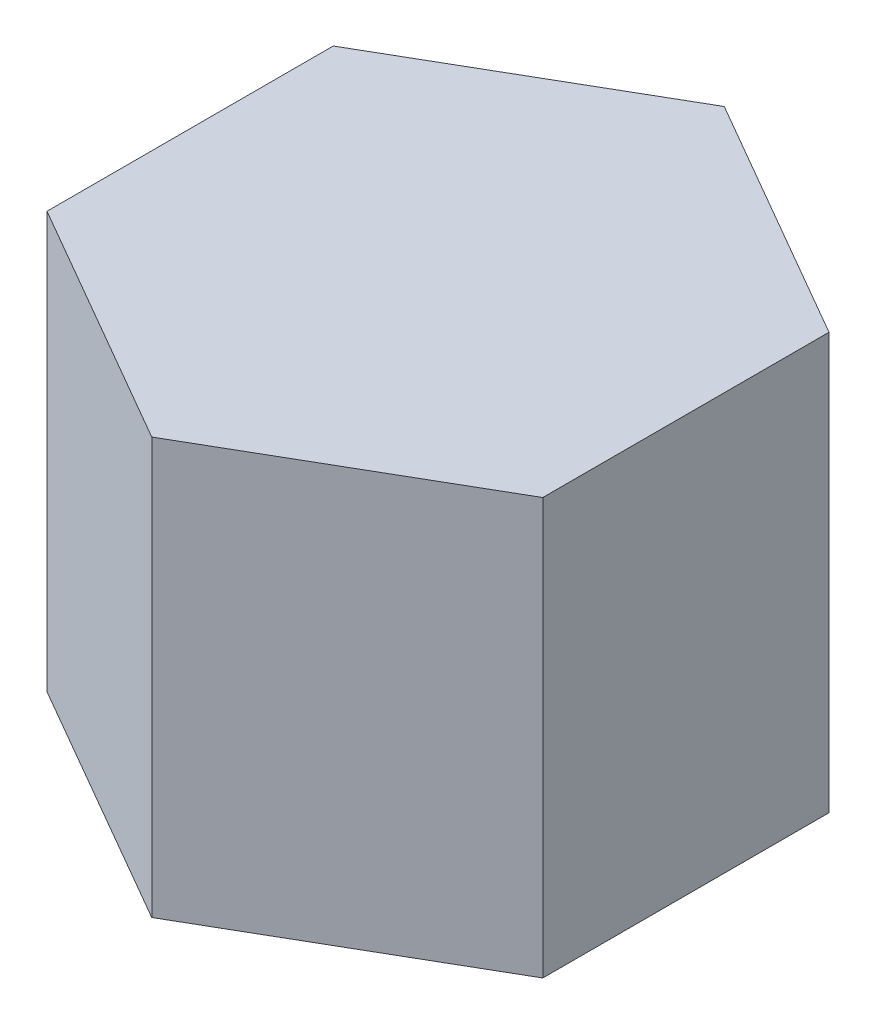
ISO-10303-21;
HEADER;
FILE_DESCRIPTION(('STEP AP214'),'2;1');
FILE_NAME('part.step','',(''),(''),'','','');
FILE_SCHEMA(('AUTOMOTIVE_DESIGN { 1 0 10303 214 1 1 1 1 }'));
ENDSEC;
DATA;
#1=APPLICATION_CONTEXT('core data for automotive mechanical design processes');
#2=APPLICATION_PROTOCOL_DEFINITION('international standard','automotive_design',2000,#1);
#3=PRODUCT_CONTEXT('',#1,'mechanical');
#4=PRODUCT('Part','Part','',(#3));
#5=PRODUCT_RELATED_PRODUCT_CATEGORY('part','',(#4));
#6=PRODUCT_DEFINITION_FORMATION('','',#4);
#7=PRODUCT_DEFINITION_CONTEXT('part definition',#1,'design');
#8=PRODUCT_DEFINITION('design','',#6,#7);
#9=PRODUCT_DEFINITION_SHAPE('','',#8);
#10=(LENGTH_UNIT() NAMED_UNIT(*) SI_UNIT(.MILLI.,.METRE.));
#11=(NAMED_UNIT(*) PLANE_ANGLE_UNIT() SI_UNIT($,.RADIAN.));
#12=(NAMED_UNIT(*) SI_UNIT($,.STERADIAN.) SOLID_ANGLE_UNIT());
#13=UNCERTAINTY_MEASURE_WITH_UNIT(LENGTH_MEASURE(1.E-05),#10,'distance_accuracy_value','');
#14=(GEOMETRIC_REPRESENTATION_CONTEXT(3) GLOBAL_UNCERTAINTY_ASSIGNED_CONTEXT((#13)) GLOBAL_UNIT_ASSIGNED_CONTEXT((#10,
#11,#12)) REPRESENTATION_CONTEXT('',''));
#15=CARTESIAN_POINT('',(0.,0.,0.));
#16=DIRECTION('',(0.,0.,1.));
#17=DIRECTION('',(1.,0.,0.));
#18=AXIS2_PLACEMENT_3D('',#15,#16,#17);
#19=CARTESIAN_POINT('',(210.839551417381,-147.556598747966,294.280047431848));
#20=DIRECTION('',(-0.499999999999943,0.,-0.866025403784471));
#21=DIRECTION('',(-0.866025403784471,0.,0.499999999999943));
#22=AXIS2_PLACEMENT_3D('',#19,#20,#21);
#23=PLANE('',#22);
#24=CARTESIAN_POINT('',(211.142660308706,-147.047793579175,294.105047431848));
#25=DIRECTION('',(-0.866025403784471,0.,0.499999999999943));
#26=VECTOR('',#25,1.);
#27=LINE('',#24,#26);
#28=CARTESIAN_POINT('',(211.142660308706,-147.047793579175,294.105047431848));
#29=VERTEX_POINT('',#28);
#30=CARTESIAN_POINT('',(210.839551417382,-147.047793579175,294.280047431848));
#31=VERTEX_POINT('',#30);
#32=EDGE_CURVE('E170',#29,#31,#27,.T.);
#33=ORIENTED_EDGE('',*,*,#32,.T.);
#34=CARTESIAN_POINT('',(210.839551417382,-147.556598747966,294.280047431848));
#35=DIRECTION('',(0.,1.,0.));
#36=VECTOR('',#35,1.);
#37=LINE('',#34,#36);
#38=CARTESIAN_POINT('',(210.839551417382,-147.556598747966,294.280047431848));
#39=VERTEX_POINT('',#38);
#40=EDGE_CURVE('E35',#39,#31,#37,.T.);
#41=ORIENTED_EDGE('',*,*,#40,.F.);
#42=CARTESIAN_POINT('',(211.142660308706,-147.556598747966,294.105047431848));
#43=DIRECTION('',(-0.866025403784471,0.,0.499999999999943));
#44=VECTOR('',#43,1.);
#45=LINE('',#42,#44);
#46=CARTESIAN_POINT('',(211.142660308706,-147.556598747966,294.105047431848));
#47=VERTEX_POINT('',#46);
#48=EDGE_CURVE('E159',#47,#39,#45,.T.);
#49=ORIENTED_EDGE('',*,*,#48,.F.);
#50=CARTESIAN_POINT('',(211.142660308706,-147.556598747966,294.105047431848));
#51=DIRECTION('',(0.,1.,0.));
#52=VECTOR('',#51,1.);
#53=LINE('',#50,#52);
#54=EDGE_CURVE('E10',#47,#29,#53,.T.);
#55=ORIENTED_EDGE('',*,*,#54,.T.);
#56=EDGE_LOOP('',(#33,#41,#49,#55));
#57=FACE_BOUND('',#56,.T.);
#58=ADVANCED_FACE('F16',(#57),#23,.F.);
#59=CARTESIAN_POINT('',(211.142660308706,-147.556598747966,291.594471220494));
#60=DIRECTION('',(-1.,0.,0.));
#61=DIRECTION('',(0.,-1.,0.));
#62=AXIS2_PLACEMENT_3D('',#59,#60,#61);
#63=PLANE('',#62);
#64=CARTESIAN_POINT('',(211.142660308706,-147.047793579175,293.755047431848));
#65=DIRECTION('',(0.,0.,1.));
#66=VECTOR('',#65,1.);
#67=LINE('',#64,#66);
#68=CARTESIAN_POINT('',(211.142660308706,-147.047793579175,293.755047431848));
#69=VERTEX_POINT('',#68);
#70=EDGE_CURVE('E167',#69,#29,#67,.T.);
#71=ORIENTED_EDGE('',*,*,#70,.T.);
#72=ORIENTED_EDGE('',*,*,#54,.F.);
#73=CARTESIAN_POINT('',(211.142660308706,-147.556598747966,293.755047431848));
#74=DIRECTION('',(0.,0.,1.));
#75=VECTOR('',#74,1.);
#76=LINE('',#73,#75);
#77=CARTESIAN_POINT('',(211.142660308706,-147.556598747966,293.755047431848));
#78=VERTEX_POINT('',#77);
#79=EDGE_CURVE('E156',#78,#47,#76,.T.);
#80=ORIENTED_EDGE('',*,*,#79,.F.);
#81=CARTESIAN_POINT('',(211.142660308706,-147.556598747966,293.755047431848));
#82=DIRECTION('',(0.,1.,0.));
#83=VECTOR('',#82,1.);
#84=LINE('',#81,#83);
#85=EDGE_CURVE('E27',#78,#69,#84,.T.);
#86=ORIENTED_EDGE('',*,*,#85,.T.);
#87=EDGE_LOOP('',(#71,#72,#80,#86));
#88=FACE_BOUND('',#87,.T.);
#89=ADVANCED_FACE('F189',(#88),#63,.F.);
#90=CARTESIAN_POINT('',(211.142660308706,-147.556598747966,293.755047431848));
#91=DIRECTION('',(-0.500000000000096,0.,0.866025403784383));
#92=DIRECTION('',(0.866025403784383,0.,0.500000000000096));
#93=AXIS2_PLACEMENT_3D('',#90,#91,#92);
#94=PLANE('',#93);
#95=CARTESIAN_POINT('',(210.839551417382,-147.047793579175,293.580047431848));
#96=DIRECTION('',(0.866025403784383,0.,0.500000000000096));
#97=VECTOR('',#96,1.);
#98=LINE('',#95,#97);
#99=CARTESIAN_POINT('',(210.839551417382,-147.047793579175,293.580047431848));
#100=VERTEX_POINT('',#99);
#101=EDGE_CURVE('E163',#100,#69,#98,.T.);
#102=ORIENTED_EDGE('',*,*,#101,.T.);
#103=ORIENTED_EDGE('',*,*,#85,.F.);
#104=CARTESIAN_POINT('',(210.839551417382,-147.556598747966,293.580047431848));
#105=DIRECTION('',(0.866025403784383,0.,0.500000000000096));
#106=VECTOR('',#105,1.);
#107=LINE('',#104,#106);
#108=CARTESIAN_POINT('',(210.839551417382,-147.556598747966,293.580047431848));
#109=VERTEX_POINT('',#108);
#110=EDGE_CURVE('E106',#109,#78,#107,.T.);
#111=ORIENTED_EDGE('',*,*,#110,.F.);
#112=CARTESIAN_POINT('',(210.839551417382,-147.556598747966,293.580047431848));
#113=DIRECTION('',(0.,1.,0.));
#114=VECTOR('',#113,1.);
#115=LINE('',#112,#114);
#116=EDGE_CURVE('E94',#109,#100,#115,.T.);
#117=ORIENTED_EDGE('',*,*,#116,.T.);
#118=EDGE_LOOP('',(#102,#103,#111,#117));
#119=FACE_BOUND('',#118,.T.);
#120=ADVANCED_FACE('F198',(#119),#94,.F.);
#121=CARTESIAN_POINT('',(210.839551417382,-147.556598747966,293.580047431848));
#122=DIRECTION('',(0.499999999999978,0.,0.866025403784452));
#123=DIRECTION('',(0.866025403784452,0.,-0.499999999999978));
#124=AXIS2_PLACEMENT_3D('',#121,#122,#123);
#125=PLANE('',#124);
#126=CARTESIAN_POINT('',(210.536442526057,-147.047793579175,293.755047431848));
#127=DIRECTION('',(0.866025403784452,0.,-0.499999999999978));
#128=VECTOR('',#127,1.);
#129=LINE('',#126,#128);
#130=CARTESIAN_POINT('',(210.536442526057,-147.047793579175,293.755047431848));
#131=VERTEX_POINT('',#130);
#132=EDGE_CURVE('E162',#131,#100,#129,.T.);
#133=ORIENTED_EDGE('',*,*,#132,.T.);
#134=ORIENTED_EDGE('',*,*,#116,.F.);
#135=CARTESIAN_POINT('',(210.536442526057,-147.556598747966,293.755047431848));
#136=DIRECTION('',(0.866025403784452,0.,-0.499999999999978));
#137=VECTOR('',#136,1.);
#138=LINE('',#135,#137);
#139=CARTESIAN_POINT('',(210.536442526057,-147.556598747966,293.755047431848));
#140=VERTEX_POINT('',#139);
#141=EDGE_CURVE('E98',#140,#109,#138,.T.);
#142=ORIENTED_EDGE('',*,*,#141,.F.);
#143=CARTESIAN_POINT('',(210.536442526057,-147.556598747966,293.755047431848));
#144=DIRECTION('',(0.,1.,0.));
#145=VECTOR('',#144,1.);
#146=LINE('',#143,#145);
#147=EDGE_CURVE('E79',#140,#131,#146,.T.);
#148=ORIENTED_EDGE('',*,*,#147,.T.);
#149=EDGE_LOOP('',(#133,#134,#142,#148));
#150=FACE_BOUND('',#149,.T.);
#151=ADVANCED_FACE('F100',(#150),#125,.F.);
#152=CARTESIAN_POINT('',(210.536442526057,-147.556598747966,291.594471220494));
#153=DIRECTION('',(1.,0.,0.));
#154=DIRECTION('',(0.,1.,0.));
#155=AXIS2_PLACEMENT_3D('',#152,#153,#154);
#156=PLANE('',#155);
#157=CARTESIAN_POINT('',(210.536442526057,-147.047793579175,294.105047431848));
#158=DIRECTION('',(0.,0.,-1.));
#159=VECTOR('',#158,1.);
#160=LINE('',#157,#159);
#161=CARTESIAN_POINT('',(210.536442526057,-147.047793579175,294.105047431848));
#162=VERTEX_POINT('',#161);
#163=EDGE_CURVE('E88',#162,#131,#160,.T.);
#164=ORIENTED_EDGE('',*,*,#163,.T.);
#165=ORIENTED_EDGE('',*,*,#147,.F.);
#166=CARTESIAN_POINT('',(210.536442526057,-147.556598747966,294.105047431848));
#167=DIRECTION('',(0.,0.,-1.));
#168=VECTOR('',#167,1.);
#169=LINE('',#166,#168);
#170=CARTESIAN_POINT('',(210.536442526057,-147.556598747966,294.105047431848));
#171=VERTEX_POINT('',#170);
#172=EDGE_CURVE('E84',#171,#140,#169,.T.);
#173=ORIENTED_EDGE('',*,*,#172,.F.);
#174=CARTESIAN_POINT('',(210.536442526057,-147.556598747966,294.105047431848));
#175=DIRECTION('',(0.,1.,0.));
#176=VECTOR('',#175,1.);
#177=LINE('',#174,#176);
#178=EDGE_CURVE('E58',#171,#162,#177,.T.);
#179=ORIENTED_EDGE('',*,*,#178,.T.);
#180=EDGE_LOOP('',(#164,#165,#173,#179));
#181=FACE_BOUND('',#180,.T.);
#182=ADVANCED_FACE('F82',(#181),#156,.F.);
#183=CARTESIAN_POINT('',(210.536442526057,-147.556598747966,294.105047431848));
#184=DIRECTION('',(0.500000000000096,0.,-0.866025403784383));
#185=DIRECTION('',(-0.866025403784383,0.,-0.500000000000096));
#186=AXIS2_PLACEMENT_3D('',#183,#184,#185);
#187=PLANE('',#186);
#188=CARTESIAN_POINT('',(210.839551417382,-147.047793579175,294.280047431848));
#189=DIRECTION('',(-0.866025403784383,0.,-0.500000000000096));
#190=VECTOR('',#189,1.);
#191=LINE('',#188,#190);
#192=EDGE_CURVE('E160',#31,#162,#191,.T.);
#193=ORIENTED_EDGE('',*,*,#192,.T.);
#194=ORIENTED_EDGE('',*,*,#178,.F.);
#195=CARTESIAN_POINT('',(210.839551417382,-147.556598747966,294.280047431848));
#196=DIRECTION('',(-0.866025403784383,0.,-0.500000000000096));
#197=VECTOR('',#196,1.);
#198=LINE('',#195,#197);
#199=EDGE_CURVE('E112',#39,#171,#198,.T.);
#200=ORIENTED_EDGE('',*,*,#199,.F.);
#201=ORIENTED_EDGE('',*,*,#40,.T.);
#202=EDGE_LOOP('',(#193,#194,#200,#201));
#203=FACE_BOUND('',#202,.T.);
#204=ADVANCED_FACE('F131',(#203),#187,.F.);
#205=CARTESIAN_POINT('',(206.491105863044,-147.556598747966,291.594471220494));
#206=DIRECTION('',(0.,1.,0.));
#207=DIRECTION('',(-1.,0.,0.));
#208=AXIS2_PLACEMENT_3D('',#205,#206,#207);
#209=PLANE('',#208);
#210=ORIENTED_EDGE('',*,*,#48,.T.);
#211=ORIENTED_EDGE('',*,*,#199,.T.);
#212=ORIENTED_EDGE('',*,*,#172,.T.);
#213=ORIENTED_EDGE('',*,*,#141,.T.);
#214=ORIENTED_EDGE('',*,*,#110,.T.);
#215=ORIENTED_EDGE('',*,*,#79,.T.);
#216=EDGE_LOOP('',(#210,#211,#212,#213,#214,#215));
#217=FACE_BOUND('',#216,.T.);
#218=ADVANCED_FACE('F111',(#217),#209,.F.);
#219=CARTESIAN_POINT('',(206.491105863044,-147.047793579175,291.594471220494));
#220=DIRECTION('',(0.,1.,0.));
#221=DIRECTION('',(-1.,0.,0.));
#222=AXIS2_PLACEMENT_3D('',#219,#220,#221);
#223=PLANE('',#222);
#224=ORIENTED_EDGE('',*,*,#32,.F.);
#225=ORIENTED_EDGE('',*,*,#70,.F.);
#226=ORIENTED_EDGE('',*,*,#101,.F.);
#227=ORIENTED_EDGE('',*,*,#132,.F.);
#228=ORIENTED_EDGE('',*,*,#163,.F.);
#229=ORIENTED_EDGE('',*,*,#192,.F.);
#230=EDGE_LOOP('',(#224,#225,#226,#227,#228,#229));
#231=FACE_BOUND('',#230,.T.);
#232=ADVANCED_FACE('F130',(#231),#223,.T.);
#233=CLOSED_SHELL('',(#58,#89,#120,#151,#182,#204,#218,#232));
#234=MANIFOLD_SOLID_BREP('B1',#233);
#235=ADVANCED_BREP_SHAPE_REPRESENTATION('',(#18,#234),#14);
#236=SHAPE_DEFINITION_REPRESENTATION(#9,#235);
ENDSEC;
END-ISO-10303-21;
